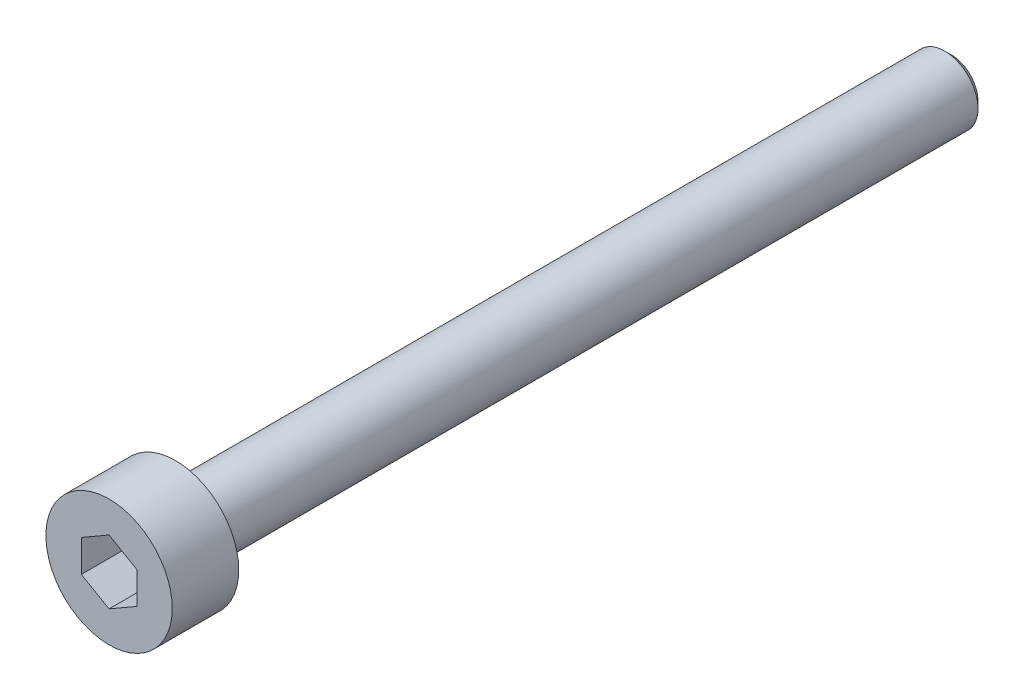
ISO-10303-21;
HEADER;
FILE_DESCRIPTION(('STEP AP214'),'2;1');
FILE_NAME('part.step','',(''),(''),'','','');
FILE_SCHEMA(('AUTOMOTIVE_DESIGN { 1 0 10303 214 1 1 1 1 }'));
ENDSEC;
DATA;
#1=APPLICATION_CONTEXT('core data for automotive mechanical design processes');
#2=APPLICATION_PROTOCOL_DEFINITION('international standard','automotive_design',2000,#1);
#3=PRODUCT_CONTEXT('',#1,'mechanical');
#4=PRODUCT('Part','Part','',(#3));
#5=PRODUCT_RELATED_PRODUCT_CATEGORY('part','',(#4));
#6=PRODUCT_DEFINITION_FORMATION('','',#4);
#7=PRODUCT_DEFINITION_CONTEXT('part definition',#1,'design');
#8=PRODUCT_DEFINITION('design','',#6,#7);
#9=PRODUCT_DEFINITION_SHAPE('','',#8);
#10=(LENGTH_UNIT() NAMED_UNIT(*) SI_UNIT(.MILLI.,.METRE.));
#11=(NAMED_UNIT(*) PLANE_ANGLE_UNIT() SI_UNIT($,.RADIAN.));
#12=(NAMED_UNIT(*) SI_UNIT($,.STERADIAN.) SOLID_ANGLE_UNIT());
#13=UNCERTAINTY_MEASURE_WITH_UNIT(LENGTH_MEASURE(1.E-05),#10,'distance_accuracy_value','');
#14=(GEOMETRIC_REPRESENTATION_CONTEXT(3) GLOBAL_UNCERTAINTY_ASSIGNED_CONTEXT((#13)) GLOBAL_UNIT_ASSIGNED_CONTEXT((#10,
#11,#12)) REPRESENTATION_CONTEXT('',''));
#15=CARTESIAN_POINT('',(0.,0.,0.));
#16=DIRECTION('',(0.,0.,1.));
#17=DIRECTION('',(1.,0.,0.));
#18=AXIS2_PLACEMENT_3D('',#15,#16,#17);
#19=CARTESIAN_POINT('',(0.,0.,0.));
#20=DIRECTION('',(0.,0.,1.));
#21=DIRECTION('',(1.,0.,0.));
#22=AXIS2_PLACEMENT_3D('',#19,#20,#21);
#23=PLANE('',#22);
#24=CARTESIAN_POINT('',(0.,0.,0.));
#25=DIRECTION('',(0.,0.,1.));
#26=DIRECTION('',(1.,0.,0.));
#27=AXIS2_PLACEMENT_3D('',#24,#25,#26);
#28=CIRCLE('',#27,2.85);
#29=CARTESIAN_POINT('',(2.85,0.,0.));
#30=VERTEX_POINT('',#29);
#31=EDGE_CURVE('E137',#30,#30,#28,.T.);
#32=ORIENTED_EDGE('',*,*,#31,.F.);
#33=EDGE_LOOP('',(#32));
#34=FACE_BOUND('',#33,.T.);
#35=CARTESIAN_POINT('',(0.,0.,0.));
#36=DIRECTION('',(0.,0.,1.));
#37=DIRECTION('',(1.,0.,0.));
#38=AXIS2_PLACEMENT_3D('',#35,#36,#37);
#39=CIRCLE('',#38,1.5);
#40=CARTESIAN_POINT('',(1.5,0.,0.));
#41=VERTEX_POINT('',#40);
#42=EDGE_CURVE('E146',#41,#41,#39,.F.);
#43=ORIENTED_EDGE('',*,*,#42,.F.);
#44=EDGE_LOOP('',(#43));
#45=FACE_BOUND('',#44,.T.);
#46=ADVANCED_FACE('F35',(#34,#45),#23,.F.);
#47=CARTESIAN_POINT('',(0.,0.,3.));
#48=DIRECTION('',(0.,0.,-1.));
#49=DIRECTION('',(-1.,0.,0.));
#50=AXIS2_PLACEMENT_3D('',#47,#48,#49);
#51=CYLINDRICAL_SURFACE('',#50,2.85);
#52=CARTESIAN_POINT('',(0.,0.,3.));
#53=DIRECTION('',(0.,0.,1.));
#54=DIRECTION('',(1.,0.,0.));
#55=AXIS2_PLACEMENT_3D('',#52,#53,#54);
#56=CIRCLE('',#55,2.85);
#57=CARTESIAN_POINT('',(2.85,0.,3.));
#58=VERTEX_POINT('',#57);
#59=EDGE_CURVE('E143',#58,#58,#56,.T.);
#60=ORIENTED_EDGE('',*,*,#59,.F.);
#61=EDGE_LOOP('',(#60));
#62=FACE_BOUND('',#61,.T.);
#63=ORIENTED_EDGE('',*,*,#31,.T.);
#64=EDGE_LOOP('',(#63));
#65=FACE_BOUND('',#64,.T.);
#66=ADVANCED_FACE('F168',(#62,#65),#51,.T.);
#67=CARTESIAN_POINT('',(0.,0.,3.));
#68=DIRECTION('',(0.,0.,1.));
#69=DIRECTION('',(1.,0.,0.));
#70=AXIS2_PLACEMENT_3D('',#67,#68,#69);
#71=PLANE('',#70);
#72=DIRECTION('',(-0.866025403784439,0.5,0.));
#73=VECTOR('',#72,1.);
#74=CARTESIAN_POINT('',(1.25,0.721687836487032,3.));
#75=LINE('',#74,#73);
#76=CARTESIAN_POINT('',(1.25,0.721687836487032,3.));
#77=VERTEX_POINT('',#76);
#78=CARTESIAN_POINT('',(0.,1.44337567297406,3.));
#79=VERTEX_POINT('',#78);
#80=EDGE_CURVE('E50',#77,#79,#75,.T.);
#81=ORIENTED_EDGE('',*,*,#80,.F.);
#82=DIRECTION('',(0.,1.,0.));
#83=VECTOR('',#82,1.);
#84=CARTESIAN_POINT('',(1.25,-0.721687836487032,3.));
#85=LINE('',#84,#83);
#86=CARTESIAN_POINT('',(1.25,-0.721687836487032,3.));
#87=VERTEX_POINT('',#86);
#88=EDGE_CURVE('E133',#87,#77,#85,.T.);
#89=ORIENTED_EDGE('',*,*,#88,.F.);
#90=DIRECTION('',(0.866025403784439,0.5,0.));
#91=VECTOR('',#90,1.);
#92=CARTESIAN_POINT('',(0.,-1.44337567297406,3.));
#93=LINE('',#92,#91);
#94=CARTESIAN_POINT('',(0.,-1.44337567297406,3.));
#95=VERTEX_POINT('',#94);
#96=EDGE_CURVE('E131',#95,#87,#93,.T.);
#97=ORIENTED_EDGE('',*,*,#96,.F.);
#98=DIRECTION('',(0.866025403784439,-0.5,0.));
#99=VECTOR('',#98,1.);
#100=CARTESIAN_POINT('',(-1.25,-0.721687836487033,3.));
#101=LINE('',#100,#99);
#102=CARTESIAN_POINT('',(-1.25,-0.721687836487033,3.));
#103=VERTEX_POINT('',#102);
#104=EDGE_CURVE('E98',#103,#95,#101,.T.);
#105=ORIENTED_EDGE('',*,*,#104,.F.);
#106=DIRECTION('',(0.,-1.,0.));
#107=VECTOR('',#106,1.);
#108=CARTESIAN_POINT('',(-1.25,0.721687836487032,3.));
#109=LINE('',#108,#107);
#110=CARTESIAN_POINT('',(-1.25,0.721687836487032,3.));
#111=VERTEX_POINT('',#110);
#112=EDGE_CURVE('E127',#111,#103,#109,.T.);
#113=ORIENTED_EDGE('',*,*,#112,.F.);
#114=DIRECTION('',(-0.866025403784439,-0.5,0.));
#115=VECTOR('',#114,1.);
#116=CARTESIAN_POINT('',(0.,1.44337567297406,3.));
#117=LINE('',#116,#115);
#118=EDGE_CURVE('E124',#79,#111,#117,.T.);
#119=ORIENTED_EDGE('',*,*,#118,.F.);
#120=EDGE_LOOP('',(#81,#89,#97,#105,#113,#119));
#121=FACE_BOUND('',#120,.T.);
#122=ORIENTED_EDGE('',*,*,#59,.T.);
#123=EDGE_LOOP('',(#122));
#124=FACE_BOUND('',#123,.T.);
#125=ADVANCED_FACE('F174',(#121,#124),#71,.T.);
#126=CARTESIAN_POINT('',(0.,0.,-35.));
#127=DIRECTION('',(0.,0.,1.));
#128=DIRECTION('',(1.,0.,0.));
#129=AXIS2_PLACEMENT_3D('',#126,#127,#128);
#130=CYLINDRICAL_SURFACE('',#129,1.5);
#131=CARTESIAN_POINT('',(0.,0.,-34.7));
#132=DIRECTION('',(0.,0.,-1.));
#133=DIRECTION('',(-1.,0.,0.));
#134=AXIS2_PLACEMENT_3D('',#131,#132,#133);
#135=CIRCLE('',#134,1.5);
#136=CARTESIAN_POINT('',(-1.5,0.,-34.7));
#137=VERTEX_POINT('',#136);
#138=EDGE_CURVE('E11',#137,#137,#135,.F.);
#139=ORIENTED_EDGE('',*,*,#138,.T.);
#140=EDGE_LOOP('',(#139));
#141=FACE_BOUND('',#140,.T.);
#142=ORIENTED_EDGE('',*,*,#42,.T.);
#143=EDGE_LOOP('',(#142));
#144=FACE_BOUND('',#143,.T.);
#145=ADVANCED_FACE('F164',(#141,#144),#130,.T.);
#146=CARTESIAN_POINT('',(0.,0.,-35.));
#147=DIRECTION('',(0.,0.,-1.));
#148=DIRECTION('',(-1.,0.,0.));
#149=AXIS2_PLACEMENT_3D('',#146,#147,#148);
#150=PLANE('',#149);
#151=CARTESIAN_POINT('',(0.,0.,-35.));
#152=DIRECTION('',(0.,0.,-1.));
#153=DIRECTION('',(-1.,0.,0.));
#154=AXIS2_PLACEMENT_3D('',#151,#152,#153);
#155=CIRCLE('',#154,1.2);
#156=CARTESIAN_POINT('',(-1.2,0.,-35.));
#157=VERTEX_POINT('',#156);
#158=EDGE_CURVE('E43',#157,#157,#155,.T.);
#159=ORIENTED_EDGE('',*,*,#158,.T.);
#160=EDGE_LOOP('',(#159));
#161=FACE_BOUND('',#160,.T.);
#162=ADVANCED_FACE('F153',(#161),#150,.T.);
#163=CARTESIAN_POINT('',(0.,0.,-35.));
#164=DIRECTION('',(0.,0.,1.));
#165=DIRECTION('',(1.,0.,0.));
#166=AXIS2_PLACEMENT_3D('',#163,#164,#165);
#167=CONICAL_SURFACE('',#166,1.2,0.785398163397441);
#168=ORIENTED_EDGE('',*,*,#138,.F.);
#169=EDGE_LOOP('',(#168));
#170=FACE_BOUND('',#169,.T.);
#171=ORIENTED_EDGE('',*,*,#158,.F.);
#172=EDGE_LOOP('',(#171));
#173=FACE_BOUND('',#172,.T.);
#174=ADVANCED_FACE('F37',(#170,#173),#167,.T.);
#175=CARTESIAN_POINT('',(1.25,0.721687836487032,1.));
#176=DIRECTION('',(0.5,0.866025403784439,0.));
#177=DIRECTION('',(-0.866025403784439,0.5,0.));
#178=AXIS2_PLACEMENT_3D('',#175,#176,#177);
#179=PLANE('',#178);
#180=ORIENTED_EDGE('',*,*,#80,.T.);
#181=DIRECTION('',(0.,0.,1.));
#182=VECTOR('',#181,1.);
#183=CARTESIAN_POINT('',(0.,1.44337567297406,1.));
#184=LINE('',#183,#182);
#185=CARTESIAN_POINT('',(0.,1.44337567297406,1.));
#186=VERTEX_POINT('',#185);
#187=EDGE_CURVE('E80',#186,#79,#184,.T.);
#188=ORIENTED_EDGE('',*,*,#187,.F.);
#189=DIRECTION('',(-0.866025403784439,0.5,0.));
#190=VECTOR('',#189,1.);
#191=CARTESIAN_POINT('',(1.25,0.721687836487032,1.));
#192=LINE('',#191,#190);
#193=CARTESIAN_POINT('',(1.25,0.721687836487032,1.));
#194=VERTEX_POINT('',#193);
#195=EDGE_CURVE('E135',#194,#186,#192,.T.);
#196=ORIENTED_EDGE('',*,*,#195,.F.);
#197=DIRECTION('',(0.,0.,1.));
#198=VECTOR('',#197,1.);
#199=CARTESIAN_POINT('',(1.25,0.721687836487032,1.));
#200=LINE('',#199,#198);
#201=EDGE_CURVE('E58',#194,#77,#200,.T.);
#202=ORIENTED_EDGE('',*,*,#201,.T.);
#203=EDGE_LOOP('',(#180,#188,#196,#202));
#204=FACE_BOUND('',#203,.T.);
#205=ADVANCED_FACE('F156',(#204),#179,.F.);
#206=CARTESIAN_POINT('',(1.25,-0.721687836487032,1.));
#207=DIRECTION('',(1.,0.,0.));
#208=DIRECTION('',(0.,1.,0.));
#209=AXIS2_PLACEMENT_3D('',#206,#207,#208);
#210=PLANE('',#209);
#211=ORIENTED_EDGE('',*,*,#88,.T.);
#212=ORIENTED_EDGE('',*,*,#201,.F.);
#213=DIRECTION('',(0.,1.,0.));
#214=VECTOR('',#213,1.);
#215=CARTESIAN_POINT('',(1.25,-0.721687836487032,1.));
#216=LINE('',#215,#214);
#217=CARTESIAN_POINT('',(1.25,-0.721687836487032,1.));
#218=VERTEX_POINT('',#217);
#219=EDGE_CURVE('E110',#218,#194,#216,.T.);
#220=ORIENTED_EDGE('',*,*,#219,.F.);
#221=DIRECTION('',(0.,0.,1.));
#222=VECTOR('',#221,1.);
#223=CARTESIAN_POINT('',(1.25,-0.721687836487032,1.));
#224=LINE('',#223,#222);
#225=EDGE_CURVE('E102',#218,#87,#224,.T.);
#226=ORIENTED_EDGE('',*,*,#225,.T.);
#227=EDGE_LOOP('',(#211,#212,#220,#226));
#228=FACE_BOUND('',#227,.T.);
#229=ADVANCED_FACE('F162',(#228),#210,.F.);
#230=CARTESIAN_POINT('',(0.,-1.44337567297406,1.));
#231=DIRECTION('',(0.5,-0.866025403784439,0.));
#232=DIRECTION('',(0.866025403784439,0.5,0.));
#233=AXIS2_PLACEMENT_3D('',#230,#231,#232);
#234=PLANE('',#233);
#235=ORIENTED_EDGE('',*,*,#96,.T.);
#236=ORIENTED_EDGE('',*,*,#225,.F.);
#237=DIRECTION('',(0.866025403784439,0.5,0.));
#238=VECTOR('',#237,1.);
#239=CARTESIAN_POINT('',(0.,-1.44337567297406,1.));
#240=LINE('',#239,#238);
#241=CARTESIAN_POINT('',(0.,-1.44337567297406,1.));
#242=VERTEX_POINT('',#241);
#243=EDGE_CURVE('E106',#242,#218,#240,.T.);
#244=ORIENTED_EDGE('',*,*,#243,.F.);
#245=DIRECTION('',(0.,0.,1.));
#246=VECTOR('',#245,1.);
#247=CARTESIAN_POINT('',(0.,-1.44337567297406,1.));
#248=LINE('',#247,#246);
#249=EDGE_CURVE('E91',#242,#95,#248,.T.);
#250=ORIENTED_EDGE('',*,*,#249,.T.);
#251=EDGE_LOOP('',(#235,#236,#244,#250));
#252=FACE_BOUND('',#251,.T.);
#253=ADVANCED_FACE('F107',(#252),#234,.F.);
#254=CARTESIAN_POINT('',(-1.25,-0.721687836487033,1.));
#255=DIRECTION('',(-0.5,-0.866025403784439,0.));
#256=DIRECTION('',(0.866025403784439,-0.5,0.));
#257=AXIS2_PLACEMENT_3D('',#254,#255,#256);
#258=PLANE('',#257);
#259=ORIENTED_EDGE('',*,*,#104,.T.);
#260=ORIENTED_EDGE('',*,*,#249,.F.);
#261=DIRECTION('',(0.866025403784439,-0.5,0.));
#262=VECTOR('',#261,1.);
#263=CARTESIAN_POINT('',(-1.25,-0.721687836487033,1.));
#264=LINE('',#263,#262);
#265=CARTESIAN_POINT('',(-1.25,-0.721687836487033,1.));
#266=VERTEX_POINT('',#265);
#267=EDGE_CURVE('E95',#266,#242,#264,.T.);
#268=ORIENTED_EDGE('',*,*,#267,.F.);
#269=DIRECTION('',(0.,0.,1.));
#270=VECTOR('',#269,1.);
#271=CARTESIAN_POINT('',(-1.25,-0.721687836487033,1.));
#272=LINE('',#271,#270);
#273=EDGE_CURVE('E103',#266,#103,#272,.T.);
#274=ORIENTED_EDGE('',*,*,#273,.T.);
#275=EDGE_LOOP('',(#259,#260,#268,#274));
#276=FACE_BOUND('',#275,.T.);
#277=ADVANCED_FACE('F93',(#276),#258,.F.);
#278=CARTESIAN_POINT('',(-1.25,0.721687836487032,1.));
#279=DIRECTION('',(-1.,0.,0.));
#280=DIRECTION('',(0.,0.,1.));
#281=AXIS2_PLACEMENT_3D('',#278,#279,#280);
#282=PLANE('',#281);
#283=ORIENTED_EDGE('',*,*,#112,.T.);
#284=ORIENTED_EDGE('',*,*,#273,.F.);
#285=DIRECTION('',(0.,-1.,0.));
#286=VECTOR('',#285,1.);
#287=CARTESIAN_POINT('',(-1.25,0.721687836487032,1.));
#288=LINE('',#287,#286);
#289=CARTESIAN_POINT('',(-1.25,0.721687836487032,1.));
#290=VERTEX_POINT('',#289);
#291=EDGE_CURVE('E116',#290,#266,#288,.T.);
#292=ORIENTED_EDGE('',*,*,#291,.F.);
#293=DIRECTION('',(0.,0.,1.));
#294=VECTOR('',#293,1.);
#295=CARTESIAN_POINT('',(-1.25,0.721687836487032,1.));
#296=LINE('',#295,#294);
#297=EDGE_CURVE('E140',#290,#111,#296,.T.);
#298=ORIENTED_EDGE('',*,*,#297,.T.);
#299=EDGE_LOOP('',(#283,#284,#292,#298));
#300=FACE_BOUND('',#299,.T.);
#301=ADVANCED_FACE('F188',(#300),#282,.F.);
#302=CARTESIAN_POINT('',(0.,1.44337567297406,1.));
#303=DIRECTION('',(-0.5,0.866025403784439,0.));
#304=DIRECTION('',(-0.866025403784439,-0.5,0.));
#305=AXIS2_PLACEMENT_3D('',#302,#303,#304);
#306=PLANE('',#305);
#307=ORIENTED_EDGE('',*,*,#118,.T.);
#308=ORIENTED_EDGE('',*,*,#297,.F.);
#309=DIRECTION('',(-0.866025403784439,-0.5,0.));
#310=VECTOR('',#309,1.);
#311=CARTESIAN_POINT('',(0.,1.44337567297406,1.));
#312=LINE('',#311,#310);
#313=EDGE_CURVE('E118',#186,#290,#312,.T.);
#314=ORIENTED_EDGE('',*,*,#313,.F.);
#315=ORIENTED_EDGE('',*,*,#187,.T.);
#316=EDGE_LOOP('',(#307,#308,#314,#315));
#317=FACE_BOUND('',#316,.T.);
#318=ADVANCED_FACE('F185',(#317),#306,.F.);
#319=CARTESIAN_POINT('',(0.,0.,1.));
#320=DIRECTION('',(0.,0.,1.));
#321=DIRECTION('',(1.,0.,0.));
#322=AXIS2_PLACEMENT_3D('',#319,#320,#321);
#323=PLANE('',#322);
#324=ORIENTED_EDGE('',*,*,#195,.T.);
#325=ORIENTED_EDGE('',*,*,#313,.T.);
#326=ORIENTED_EDGE('',*,*,#291,.T.);
#327=ORIENTED_EDGE('',*,*,#267,.T.);
#328=ORIENTED_EDGE('',*,*,#243,.T.);
#329=ORIENTED_EDGE('',*,*,#219,.T.);
#330=EDGE_LOOP('',(#324,#325,#326,#327,#328,#329));
#331=FACE_BOUND('',#330,.T.);
#332=ADVANCED_FACE('F113',(#331),#323,.T.);
#333=CLOSED_SHELL('',(#46,#66,#125,#145,#162,#174,#205,#229,#253,#277,#301,#318,#332));
#334=MANIFOLD_SOLID_BREP('B2',#333);
#335=ADVANCED_BREP_SHAPE_REPRESENTATION('',(#18,#334),#14);
#336=SHAPE_DEFINITION_REPRESENTATION(#9,#335);
ENDSEC;
END-ISO-10303-21;
